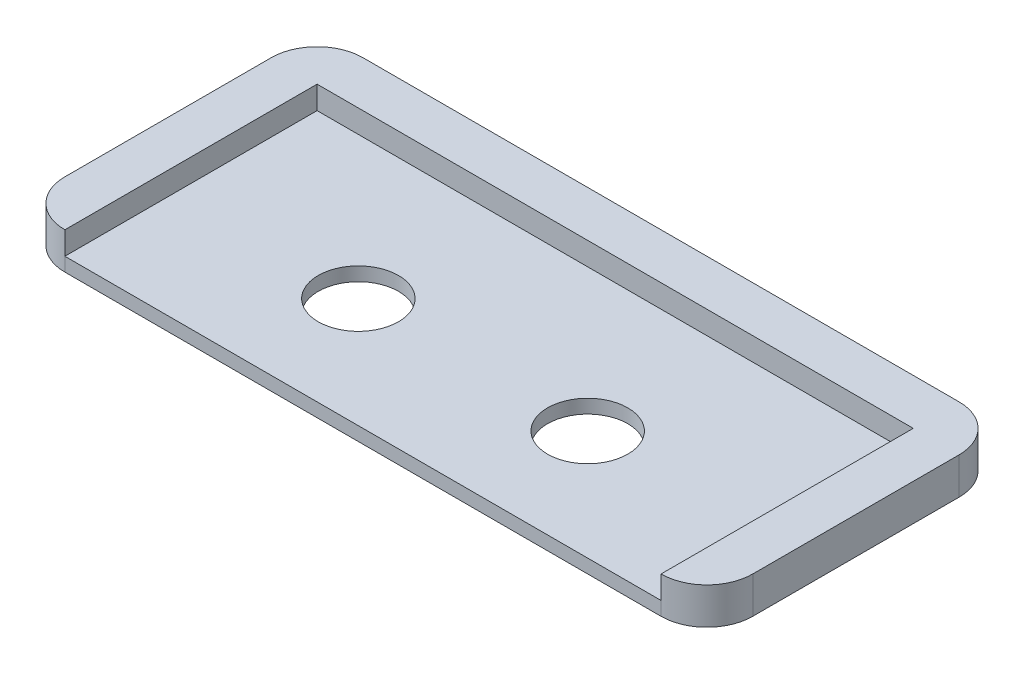
ISO-10303-21;
HEADER;
FILE_DESCRIPTION(('STEP AP214'),'2;1');
FILE_NAME('part.step','',(''),(''),'','','');
FILE_SCHEMA(('AUTOMOTIVE_DESIGN { 1 0 10303 214 1 1 1 1 }'));
ENDSEC;
DATA;
#1=APPLICATION_CONTEXT('core data for automotive mechanical design processes');
#2=APPLICATION_PROTOCOL_DEFINITION('international standard','automotive_design',2000,#1);
#3=PRODUCT_CONTEXT('',#1,'mechanical');
#4=PRODUCT('Part','Part','',(#3));
#5=PRODUCT_RELATED_PRODUCT_CATEGORY('part','',(#4));
#6=PRODUCT_DEFINITION_FORMATION('','',#4);
#7=PRODUCT_DEFINITION_CONTEXT('part definition',#1,'design');
#8=PRODUCT_DEFINITION('design','',#6,#7);
#9=PRODUCT_DEFINITION_SHAPE('','',#8);
#10=(LENGTH_UNIT() NAMED_UNIT(*) SI_UNIT(.MILLI.,.METRE.));
#11=(NAMED_UNIT(*) PLANE_ANGLE_UNIT() SI_UNIT($,.RADIAN.));
#12=(NAMED_UNIT(*) SI_UNIT($,.STERADIAN.) SOLID_ANGLE_UNIT());
#13=UNCERTAINTY_MEASURE_WITH_UNIT(LENGTH_MEASURE(1.E-05),#10,'distance_accuracy_value','');
#14=(GEOMETRIC_REPRESENTATION_CONTEXT(3) GLOBAL_UNCERTAINTY_ASSIGNED_CONTEXT((#13)) GLOBAL_UNIT_ASSIGNED_CONTEXT((#10,
#11,#12)) REPRESENTATION_CONTEXT('',''));
#15=CARTESIAN_POINT('',(0.,0.,0.));
#16=DIRECTION('',(0.,0.,1.));
#17=DIRECTION('',(1.,0.,0.));
#18=AXIS2_PLACEMENT_3D('',#15,#16,#17);
#19=CARTESIAN_POINT('',(15.,0.6,-6.5));
#20=DIRECTION('',(-1.,0.,0.));
#21=DIRECTION('',(0.,0.,1.));
#22=AXIS2_PLACEMENT_3D('',#19,#20,#21);
#23=PLANE('',#22);
#24=DIRECTION('',(0.,0.,-1.));
#25=VECTOR('',#24,1.);
#26=CARTESIAN_POINT('',(15.,1.6,-6.5));
#27=LINE('',#26,#25);
#28=CARTESIAN_POINT('',(15.,1.6,4.5));
#29=VERTEX_POINT('',#28);
#30=CARTESIAN_POINT('',(15.,1.6,-4.5));
#31=VERTEX_POINT('',#30);
#32=EDGE_CURVE('E198',#29,#31,#27,.T.);
#33=ORIENTED_EDGE('',*,*,#32,.F.);
#34=DIRECTION('',(0.,-1.,0.));
#35=VECTOR('',#34,1.);
#36=CARTESIAN_POINT('',(15.,0.6,4.5));
#37=LINE('',#36,#35);
#38=CARTESIAN_POINT('',(15.,0.,4.5));
#39=VERTEX_POINT('',#38);
#40=EDGE_CURVE('E188',#29,#39,#37,.T.);
#41=ORIENTED_EDGE('',*,*,#40,.T.);
#42=DIRECTION('',(0.,0.,-1.));
#43=VECTOR('',#42,1.);
#44=CARTESIAN_POINT('',(15.,0.,-6.5));
#45=LINE('',#44,#43);
#46=CARTESIAN_POINT('',(15.,0.,-4.5));
#47=VERTEX_POINT('',#46);
#48=EDGE_CURVE('E149',#39,#47,#45,.T.);
#49=ORIENTED_EDGE('',*,*,#48,.T.);
#50=DIRECTION('',(0.,-1.,0.));
#51=VECTOR('',#50,1.);
#52=CARTESIAN_POINT('',(15.,0.6,-4.5));
#53=LINE('',#52,#51);
#54=EDGE_CURVE('E131',#47,#31,#53,.F.);
#55=ORIENTED_EDGE('',*,*,#54,.T.);
#56=EDGE_LOOP('',(#33,#41,#49,#55));
#57=FACE_BOUND('',#56,.T.);
#58=ADVANCED_FACE('F39',(#57),#23,.F.);
#59=CARTESIAN_POINT('',(-15.,0.6,-6.5));
#60=DIRECTION('',(0.,0.,1.));
#61=DIRECTION('',(1.,0.,0.));
#62=AXIS2_PLACEMENT_3D('',#59,#60,#61);
#63=PLANE('',#62);
#64=DIRECTION('',(-1.,0.,0.));
#65=VECTOR('',#64,1.);
#66=CARTESIAN_POINT('',(-15.,1.6,-6.5));
#67=LINE('',#66,#65);
#68=CARTESIAN_POINT('',(13.,1.6,-6.5));
#69=VERTEX_POINT('',#68);
#70=CARTESIAN_POINT('',(-13.,1.6,-6.5));
#71=VERTEX_POINT('',#70);
#72=EDGE_CURVE('E210',#69,#71,#67,.T.);
#73=ORIENTED_EDGE('',*,*,#72,.F.);
#74=DIRECTION('',(0.,-1.,0.));
#75=VECTOR('',#74,1.);
#76=CARTESIAN_POINT('',(13.,0.6,-6.5));
#77=LINE('',#76,#75);
#78=CARTESIAN_POINT('',(13.,0.,-6.5));
#79=VERTEX_POINT('',#78);
#80=EDGE_CURVE('E11',#69,#79,#77,.T.);
#81=ORIENTED_EDGE('',*,*,#80,.T.);
#82=DIRECTION('',(-1.,0.,0.));
#83=VECTOR('',#82,1.);
#84=CARTESIAN_POINT('',(-15.,0.,-6.5));
#85=LINE('',#84,#83);
#86=CARTESIAN_POINT('',(-13.,0.,-6.5));
#87=VERTEX_POINT('',#86);
#88=EDGE_CURVE('E155',#79,#87,#85,.T.);
#89=ORIENTED_EDGE('',*,*,#88,.T.);
#90=DIRECTION('',(0.,-1.,0.));
#91=VECTOR('',#90,1.);
#92=CARTESIAN_POINT('',(-13.,0.6,-6.5));
#93=LINE('',#92,#91);
#94=EDGE_CURVE('E50',#87,#71,#93,.F.);
#95=ORIENTED_EDGE('',*,*,#94,.T.);
#96=EDGE_LOOP('',(#73,#81,#89,#95));
#97=FACE_BOUND('',#96,.T.);
#98=ADVANCED_FACE('F206',(#97),#63,.F.);
#99=CARTESIAN_POINT('',(-15.,0.6,-6.5));
#100=DIRECTION('',(1.,0.,0.));
#101=DIRECTION('',(0.,0.,-1.));
#102=AXIS2_PLACEMENT_3D('',#99,#100,#101);
#103=PLANE('',#102);
#104=DIRECTION('',(0.,0.,1.));
#105=VECTOR('',#104,1.);
#106=CARTESIAN_POINT('',(-15.,0.,-6.5));
#107=LINE('',#106,#105);
#108=CARTESIAN_POINT('',(-15.,0.,-4.5));
#109=VERTEX_POINT('',#108);
#110=CARTESIAN_POINT('',(-15.,0.,4.5));
#111=VERTEX_POINT('',#110);
#112=EDGE_CURVE('E163',#109,#111,#107,.T.);
#113=ORIENTED_EDGE('',*,*,#112,.T.);
#114=DIRECTION('',(0.,-1.,0.));
#115=VECTOR('',#114,1.);
#116=CARTESIAN_POINT('',(-15.,0.6,4.5));
#117=LINE('',#116,#115);
#118=CARTESIAN_POINT('',(-15.,1.6,4.5));
#119=VERTEX_POINT('',#118);
#120=EDGE_CURVE('E185',#111,#119,#117,.F.);
#121=ORIENTED_EDGE('',*,*,#120,.T.);
#122=DIRECTION('',(0.,0.,1.));
#123=VECTOR('',#122,1.);
#124=CARTESIAN_POINT('',(-15.,1.6,-6.5));
#125=LINE('',#124,#123);
#126=CARTESIAN_POINT('',(-15.,1.6,-4.5));
#127=VERTEX_POINT('',#126);
#128=EDGE_CURVE('E126',#127,#119,#125,.T.);
#129=ORIENTED_EDGE('',*,*,#128,.F.);
#130=DIRECTION('',(0.,-1.,0.));
#131=VECTOR('',#130,1.);
#132=CARTESIAN_POINT('',(-15.,0.6,-4.5));
#133=LINE('',#132,#131);
#134=EDGE_CURVE('E179',#127,#109,#133,.T.);
#135=ORIENTED_EDGE('',*,*,#134,.T.);
#136=EDGE_LOOP('',(#113,#121,#129,#135));
#137=FACE_BOUND('',#136,.T.);
#138=ADVANCED_FACE('F278',(#137),#103,.F.);
#139=CARTESIAN_POINT('',(-15.,0.6,6.5));
#140=DIRECTION('',(0.,0.,-1.));
#141=DIRECTION('',(-1.,0.,0.));
#142=AXIS2_PLACEMENT_3D('',#139,#140,#141);
#143=PLANE('',#142);
#144=DIRECTION('',(1.,0.,0.));
#145=VECTOR('',#144,1.);
#146=CARTESIAN_POINT('',(-15.,0.6,6.5));
#147=LINE('',#146,#145);
#148=CARTESIAN_POINT('',(-13.,0.6,6.5));
#149=VERTEX_POINT('',#148);
#150=CARTESIAN_POINT('',(13.,0.6,6.5));
#151=VERTEX_POINT('',#150);
#152=EDGE_CURVE('E158',#149,#151,#147,.T.);
#153=ORIENTED_EDGE('',*,*,#152,.F.);
#154=DIRECTION('',(0.,-1.,0.));
#155=VECTOR('',#154,1.);
#156=CARTESIAN_POINT('',(-13.,0.6,6.5));
#157=LINE('',#156,#155);
#158=CARTESIAN_POINT('',(-13.,0.,6.5));
#159=VERTEX_POINT('',#158);
#160=EDGE_CURVE('E150',#149,#159,#157,.T.);
#161=ORIENTED_EDGE('',*,*,#160,.T.);
#162=DIRECTION('',(1.,0.,0.));
#163=VECTOR('',#162,1.);
#164=CARTESIAN_POINT('',(-15.,0.,6.5));
#165=LINE('',#164,#163);
#166=CARTESIAN_POINT('',(13.,0.,6.5));
#167=VERTEX_POINT('',#166);
#168=EDGE_CURVE('E161',#159,#167,#165,.T.);
#169=ORIENTED_EDGE('',*,*,#168,.T.);
#170=DIRECTION('',(0.,-1.,0.));
#171=VECTOR('',#170,1.);
#172=CARTESIAN_POINT('',(13.,0.6,6.5));
#173=LINE('',#172,#171);
#174=EDGE_CURVE('E159',#167,#151,#173,.F.);
#175=ORIENTED_EDGE('',*,*,#174,.T.);
#176=EDGE_LOOP('',(#153,#161,#169,#175));
#177=FACE_BOUND('',#176,.T.);
#178=ADVANCED_FACE('F240',(#177),#143,.F.);
#179=CARTESIAN_POINT('',(0.,0.6,0.));
#180=DIRECTION('',(0.,1.,0.));
#181=DIRECTION('',(0.,0.,1.));
#182=AXIS2_PLACEMENT_3D('',#179,#180,#181);
#183=PLANE('',#182);
#184=CARTESIAN_POINT('',(-5.,0.6,1.7));
#185=DIRECTION('',(0.,1.,0.));
#186=DIRECTION('',(0.,0.,1.));
#187=AXIS2_PLACEMENT_3D('',#184,#185,#186);
#188=CIRCLE('',#187,1.75);
#189=CARTESIAN_POINT('',(-5.,0.6,3.45));
#190=VERTEX_POINT('',#189);
#191=EDGE_CURVE('E219',#190,#190,#188,.T.);
#192=ORIENTED_EDGE('',*,*,#191,.F.);
#193=EDGE_LOOP('',(#192));
#194=FACE_BOUND('',#193,.T.);
#195=CARTESIAN_POINT('',(5.,0.6,1.7));
#196=DIRECTION('',(0.,1.,0.));
#197=DIRECTION('',(0.,0.,1.));
#198=AXIS2_PLACEMENT_3D('',#195,#196,#197);
#199=CIRCLE('',#198,1.75);
#200=CARTESIAN_POINT('',(5.,0.6,3.45));
#201=VERTEX_POINT('',#200);
#202=EDGE_CURVE('E242',#201,#201,#199,.T.);
#203=ORIENTED_EDGE('',*,*,#202,.F.);
#204=EDGE_LOOP('',(#203));
#205=FACE_BOUND('',#204,.T.);
#206=DIRECTION('',(0.,0.,1.));
#207=VECTOR('',#206,1.);
#208=CARTESIAN_POINT('',(13.,0.6,-4.5));
#209=LINE('',#208,#207);
#210=CARTESIAN_POINT('',(13.,0.6,-4.5));
#211=VERTEX_POINT('',#210);
#212=EDGE_CURVE('E224',#211,#151,#209,.T.);
#213=ORIENTED_EDGE('',*,*,#212,.F.);
#214=DIRECTION('',(1.,0.,0.));
#215=VECTOR('',#214,1.);
#216=CARTESIAN_POINT('',(-13.,0.6,-4.5));
#217=LINE('',#216,#215);
#218=CARTESIAN_POINT('',(-13.,0.6,-4.5));
#219=VERTEX_POINT('',#218);
#220=EDGE_CURVE('E218',#219,#211,#217,.T.);
#221=ORIENTED_EDGE('',*,*,#220,.F.);
#222=DIRECTION('',(0.,0.,-1.));
#223=VECTOR('',#222,1.);
#224=CARTESIAN_POINT('',(-13.,0.6,-4.5));
#225=LINE('',#224,#223);
#226=EDGE_CURVE('E220',#149,#219,#225,.T.);
#227=ORIENTED_EDGE('',*,*,#226,.F.);
#228=ORIENTED_EDGE('',*,*,#152,.T.);
#229=EDGE_LOOP('',(#213,#221,#227,#228));
#230=FACE_BOUND('',#229,.T.);
#231=ADVANCED_FACE('F234',(#194,#205,#230),#183,.T.);
#232=CARTESIAN_POINT('',(0.,0.,0.));
#233=DIRECTION('',(0.,1.,0.));
#234=DIRECTION('',(0.,0.,1.));
#235=AXIS2_PLACEMENT_3D('',#232,#233,#234);
#236=PLANE('',#235);
#237=CARTESIAN_POINT('',(-5.,0.,1.7));
#238=DIRECTION('',(0.,-1.,0.));
#239=DIRECTION('',(0.,0.,-1.));
#240=AXIS2_PLACEMENT_3D('',#237,#238,#239);
#241=CIRCLE('',#240,1.75);
#242=CARTESIAN_POINT('',(-5.,0.,-0.049999999999998));
#243=VERTEX_POINT('',#242);
#244=EDGE_CURVE('E248',#243,#243,#241,.T.);
#245=ORIENTED_EDGE('',*,*,#244,.F.);
#246=EDGE_LOOP('',(#245));
#247=FACE_BOUND('',#246,.T.);
#248=CARTESIAN_POINT('',(5.,0.,1.7));
#249=DIRECTION('',(0.,-1.,0.));
#250=DIRECTION('',(0.,0.,-1.));
#251=AXIS2_PLACEMENT_3D('',#248,#249,#250);
#252=CIRCLE('',#251,1.75);
#253=CARTESIAN_POINT('',(5.,0.,-0.0499999999999962));
#254=VERTEX_POINT('',#253);
#255=EDGE_CURVE('E249',#254,#254,#252,.T.);
#256=ORIENTED_EDGE('',*,*,#255,.F.);
#257=EDGE_LOOP('',(#256));
#258=FACE_BOUND('',#257,.T.);
#259=ORIENTED_EDGE('',*,*,#168,.F.);
#260=CARTESIAN_POINT('',(-13.,0.,4.5));
#261=DIRECTION('',(0.,1.,0.));
#262=DIRECTION('',(0.,0.,1.));
#263=AXIS2_PLACEMENT_3D('',#260,#261,#262);
#264=CIRCLE('',#263,2.);
#265=EDGE_CURVE('E180',#159,#111,#264,.F.);
#266=ORIENTED_EDGE('',*,*,#265,.T.);
#267=ORIENTED_EDGE('',*,*,#112,.F.);
#268=CARTESIAN_POINT('',(-13.,0.,-4.5));
#269=DIRECTION('',(0.,1.,0.));
#270=DIRECTION('',(0.,0.,1.));
#271=AXIS2_PLACEMENT_3D('',#268,#269,#270);
#272=CIRCLE('',#271,2.);
#273=EDGE_CURVE('E174',#109,#87,#272,.F.);
#274=ORIENTED_EDGE('',*,*,#273,.T.);
#275=ORIENTED_EDGE('',*,*,#88,.F.);
#276=CARTESIAN_POINT('',(13.,0.,-4.5));
#277=DIRECTION('',(0.,1.,0.));
#278=DIRECTION('',(0.,0.,1.));
#279=AXIS2_PLACEMENT_3D('',#276,#277,#278);
#280=CIRCLE('',#279,2.);
#281=EDGE_CURVE('E175',#79,#47,#280,.F.);
#282=ORIENTED_EDGE('',*,*,#281,.T.);
#283=ORIENTED_EDGE('',*,*,#48,.F.);
#284=CARTESIAN_POINT('',(13.,0.,4.5));
#285=DIRECTION('',(0.,1.,0.));
#286=DIRECTION('',(0.,0.,1.));
#287=AXIS2_PLACEMENT_3D('',#284,#285,#286);
#288=CIRCLE('',#287,2.);
#289=EDGE_CURVE('E172',#39,#167,#288,.F.);
#290=ORIENTED_EDGE('',*,*,#289,.T.);
#291=EDGE_LOOP('',(#259,#266,#267,#274,#275,#282,#283,#290));
#292=FACE_BOUND('',#291,.T.);
#293=ADVANCED_FACE('F203',(#247,#258,#292),#236,.F.);
#294=CARTESIAN_POINT('',(-13.,1.6,-4.5));
#295=DIRECTION('',(-1.,0.,0.));
#296=DIRECTION('',(0.,0.,1.));
#297=AXIS2_PLACEMENT_3D('',#294,#295,#296);
#298=PLANE('',#297);
#299=ORIENTED_EDGE('',*,*,#226,.T.);
#300=DIRECTION('',(0.,-1.,0.));
#301=VECTOR('',#300,1.);
#302=CARTESIAN_POINT('',(-13.,1.6,-4.5));
#303=LINE('',#302,#301);
#304=CARTESIAN_POINT('',(-13.,1.6,-4.5));
#305=VERTEX_POINT('',#304);
#306=EDGE_CURVE('E143',#305,#219,#303,.T.);
#307=ORIENTED_EDGE('',*,*,#306,.F.);
#308=DIRECTION('',(0.,0.,-1.));
#309=VECTOR('',#308,1.);
#310=CARTESIAN_POINT('',(-13.,1.6,-4.5));
#311=LINE('',#310,#309);
#312=CARTESIAN_POINT('',(-13.,1.6,6.5));
#313=VERTEX_POINT('',#312);
#314=EDGE_CURVE('E121',#313,#305,#311,.T.);
#315=ORIENTED_EDGE('',*,*,#314,.F.);
#316=DIRECTION('',(0.,-1.,0.));
#317=VECTOR('',#316,1.);
#318=CARTESIAN_POINT('',(-13.,1.6,6.5));
#319=LINE('',#318,#317);
#320=EDGE_CURVE('E139',#313,#149,#319,.T.);
#321=ORIENTED_EDGE('',*,*,#320,.T.);
#322=EDGE_LOOP('',(#299,#307,#315,#321));
#323=FACE_BOUND('',#322,.T.);
#324=ADVANCED_FACE('F138',(#323),#298,.F.);
#325=CARTESIAN_POINT('',(-13.,1.6,-4.5));
#326=DIRECTION('',(0.,0.,-1.));
#327=DIRECTION('',(-1.,0.,0.));
#328=AXIS2_PLACEMENT_3D('',#325,#326,#327);
#329=PLANE('',#328);
#330=ORIENTED_EDGE('',*,*,#220,.T.);
#331=DIRECTION('',(0.,-1.,0.));
#332=VECTOR('',#331,1.);
#333=CARTESIAN_POINT('',(13.,1.6,-4.5));
#334=LINE('',#333,#332);
#335=CARTESIAN_POINT('',(13.,1.6,-4.5));
#336=VERTEX_POINT('',#335);
#337=EDGE_CURVE('E152',#336,#211,#334,.T.);
#338=ORIENTED_EDGE('',*,*,#337,.F.);
#339=DIRECTION('',(1.,0.,0.));
#340=VECTOR('',#339,1.);
#341=CARTESIAN_POINT('',(-13.,1.6,-4.5));
#342=LINE('',#341,#340);
#343=EDGE_CURVE('E141',#305,#336,#342,.T.);
#344=ORIENTED_EDGE('',*,*,#343,.F.);
#345=ORIENTED_EDGE('',*,*,#306,.T.);
#346=EDGE_LOOP('',(#330,#338,#344,#345));
#347=FACE_BOUND('',#346,.T.);
#348=ADVANCED_FACE('F235',(#347),#329,.F.);
#349=CARTESIAN_POINT('',(13.,1.6,-4.5));
#350=DIRECTION('',(1.,0.,0.));
#351=DIRECTION('',(0.,0.,-1.));
#352=AXIS2_PLACEMENT_3D('',#349,#350,#351);
#353=PLANE('',#352);
#354=ORIENTED_EDGE('',*,*,#212,.T.);
#355=DIRECTION('',(0.,-1.,0.));
#356=VECTOR('',#355,1.);
#357=CARTESIAN_POINT('',(13.,1.6,6.5));
#358=LINE('',#357,#356);
#359=CARTESIAN_POINT('',(13.,1.6,6.5));
#360=VERTEX_POINT('',#359);
#361=EDGE_CURVE('E207',#360,#151,#358,.T.);
#362=ORIENTED_EDGE('',*,*,#361,.F.);
#363=DIRECTION('',(0.,0.,1.));
#364=VECTOR('',#363,1.);
#365=CARTESIAN_POINT('',(13.,1.6,-4.5));
#366=LINE('',#365,#364);
#367=EDGE_CURVE('E213',#336,#360,#366,.T.);
#368=ORIENTED_EDGE('',*,*,#367,.F.);
#369=ORIENTED_EDGE('',*,*,#337,.T.);
#370=EDGE_LOOP('',(#354,#362,#368,#369));
#371=FACE_BOUND('',#370,.T.);
#372=ADVANCED_FACE('F228',(#371),#353,.F.);
#373=CARTESIAN_POINT('',(0.,1.6,0.));
#374=DIRECTION('',(0.,-1.,0.));
#375=DIRECTION('',(0.,0.,-1.));
#376=AXIS2_PLACEMENT_3D('',#373,#374,#375);
#377=PLANE('',#376);
#378=ORIENTED_EDGE('',*,*,#128,.T.);
#379=CARTESIAN_POINT('',(-13.,1.6,4.5));
#380=DIRECTION('',(0.,-1.,0.));
#381=DIRECTION('',(0.,0.,-1.));
#382=AXIS2_PLACEMENT_3D('',#379,#380,#381);
#383=CIRCLE('',#382,2.);
#384=EDGE_CURVE('E125',#119,#313,#383,.F.);
#385=ORIENTED_EDGE('',*,*,#384,.T.);
#386=ORIENTED_EDGE('',*,*,#314,.T.);
#387=ORIENTED_EDGE('',*,*,#343,.T.);
#388=ORIENTED_EDGE('',*,*,#367,.T.);
#389=CARTESIAN_POINT('',(13.,1.6,4.5));
#390=DIRECTION('',(0.,-1.,0.));
#391=DIRECTION('',(0.,0.,-1.));
#392=AXIS2_PLACEMENT_3D('',#389,#390,#391);
#393=CIRCLE('',#392,2.);
#394=EDGE_CURVE('E135',#360,#29,#393,.F.);
#395=ORIENTED_EDGE('',*,*,#394,.T.);
#396=ORIENTED_EDGE('',*,*,#32,.T.);
#397=CARTESIAN_POINT('',(13.,1.6,-4.5));
#398=DIRECTION('',(0.,-1.,0.));
#399=DIRECTION('',(0.,0.,-1.));
#400=AXIS2_PLACEMENT_3D('',#397,#398,#399);
#401=CIRCLE('',#400,2.);
#402=EDGE_CURVE('E58',#31,#69,#401,.F.);
#403=ORIENTED_EDGE('',*,*,#402,.T.);
#404=ORIENTED_EDGE('',*,*,#72,.T.);
#405=CARTESIAN_POINT('',(-13.,1.6,-4.5));
#406=DIRECTION('',(0.,-1.,0.));
#407=DIRECTION('',(0.,0.,-1.));
#408=AXIS2_PLACEMENT_3D('',#405,#406,#407);
#409=CIRCLE('',#408,2.);
#410=EDGE_CURVE('E184',#71,#127,#409,.F.);
#411=ORIENTED_EDGE('',*,*,#410,.T.);
#412=EDGE_LOOP('',(#378,#385,#386,#387,#388,#395,#396,#403,#404,#411));
#413=FACE_BOUND('',#412,.T.);
#414=ADVANCED_FACE('F124',(#413),#377,.F.);
#415=CARTESIAN_POINT('',(-13.,0.6,4.5));
#416=DIRECTION('',(0.,-1.,0.));
#417=DIRECTION('',(0.,0.,-1.));
#418=AXIS2_PLACEMENT_3D('',#415,#416,#417);
#419=CYLINDRICAL_SURFACE('',#418,2.);
#420=ORIENTED_EDGE('',*,*,#384,.F.);
#421=ORIENTED_EDGE('',*,*,#120,.F.);
#422=ORIENTED_EDGE('',*,*,#265,.F.);
#423=ORIENTED_EDGE('',*,*,#160,.F.);
#424=ORIENTED_EDGE('',*,*,#320,.F.);
#425=EDGE_LOOP('',(#420,#421,#422,#423,#424));
#426=FACE_BOUND('',#425,.T.);
#427=ADVANCED_FACE('F144',(#426),#419,.T.);
#428=CARTESIAN_POINT('',(13.,0.6,4.5));
#429=DIRECTION('',(0.,-1.,0.));
#430=DIRECTION('',(0.,0.,-1.));
#431=AXIS2_PLACEMENT_3D('',#428,#429,#430);
#432=CYLINDRICAL_SURFACE('',#431,2.);
#433=ORIENTED_EDGE('',*,*,#361,.T.);
#434=ORIENTED_EDGE('',*,*,#174,.F.);
#435=ORIENTED_EDGE('',*,*,#289,.F.);
#436=ORIENTED_EDGE('',*,*,#40,.F.);
#437=ORIENTED_EDGE('',*,*,#394,.F.);
#438=EDGE_LOOP('',(#433,#434,#435,#436,#437));
#439=FACE_BOUND('',#438,.T.);
#440=ADVANCED_FACE('F239',(#439),#432,.T.);
#441=CARTESIAN_POINT('',(13.,0.6,-4.5));
#442=DIRECTION('',(0.,-1.,0.));
#443=DIRECTION('',(0.,0.,-1.));
#444=AXIS2_PLACEMENT_3D('',#441,#442,#443);
#445=CYLINDRICAL_SURFACE('',#444,2.);
#446=ORIENTED_EDGE('',*,*,#402,.F.);
#447=ORIENTED_EDGE('',*,*,#54,.F.);
#448=ORIENTED_EDGE('',*,*,#281,.F.);
#449=ORIENTED_EDGE('',*,*,#80,.F.);
#450=EDGE_LOOP('',(#446,#447,#448,#449));
#451=FACE_BOUND('',#450,.T.);
#452=ADVANCED_FACE('F202',(#451),#445,.T.);
#453=CARTESIAN_POINT('',(-13.,0.6,-4.5));
#454=DIRECTION('',(0.,-1.,0.));
#455=DIRECTION('',(0.,0.,-1.));
#456=AXIS2_PLACEMENT_3D('',#453,#454,#455);
#457=CYLINDRICAL_SURFACE('',#456,2.);
#458=ORIENTED_EDGE('',*,*,#410,.F.);
#459=ORIENTED_EDGE('',*,*,#94,.F.);
#460=ORIENTED_EDGE('',*,*,#273,.F.);
#461=ORIENTED_EDGE('',*,*,#134,.F.);
#462=EDGE_LOOP('',(#458,#459,#460,#461));
#463=FACE_BOUND('',#462,.T.);
#464=ADVANCED_FACE('F41',(#463),#457,.T.);
#465=CARTESIAN_POINT('',(5.,1.6,1.7));
#466=DIRECTION('',(0.,-1.,0.));
#467=DIRECTION('',(0.,0.,-1.));
#468=AXIS2_PLACEMENT_3D('',#465,#466,#467);
#469=CYLINDRICAL_SURFACE('',#468,1.75);
#470=ORIENTED_EDGE('',*,*,#202,.T.);
#471=EDGE_LOOP('',(#470));
#472=FACE_BOUND('',#471,.T.);
#473=ORIENTED_EDGE('',*,*,#255,.T.);
#474=EDGE_LOOP('',(#473));
#475=FACE_BOUND('',#474,.T.);
#476=ADVANCED_FACE('F265',(#472,#475),#469,.F.);
#477=CARTESIAN_POINT('',(-5.,1.6,1.7));
#478=DIRECTION('',(0.,-1.,0.));
#479=DIRECTION('',(0.,0.,-1.));
#480=AXIS2_PLACEMENT_3D('',#477,#478,#479);
#481=CYLINDRICAL_SURFACE('',#480,1.75);
#482=ORIENTED_EDGE('',*,*,#191,.T.);
#483=EDGE_LOOP('',(#482));
#484=FACE_BOUND('',#483,.T.);
#485=ORIENTED_EDGE('',*,*,#244,.T.);
#486=EDGE_LOOP('',(#485));
#487=FACE_BOUND('',#486,.T.);
#488=ADVANCED_FACE('F254',(#484,#487),#481,.F.);
#489=CLOSED_SHELL('',(#58,#98,#138,#178,#231,#293,#324,#348,#372,#414,#427,#440,#452,#464,#476,#488));
#490=MANIFOLD_SOLID_BREP('B2',#489);
#491=ADVANCED_BREP_SHAPE_REPRESENTATION('',(#18,#490),#14);
#492=SHAPE_DEFINITION_REPRESENTATION(#9,#491);
ENDSEC;
END-ISO-10303-21;
